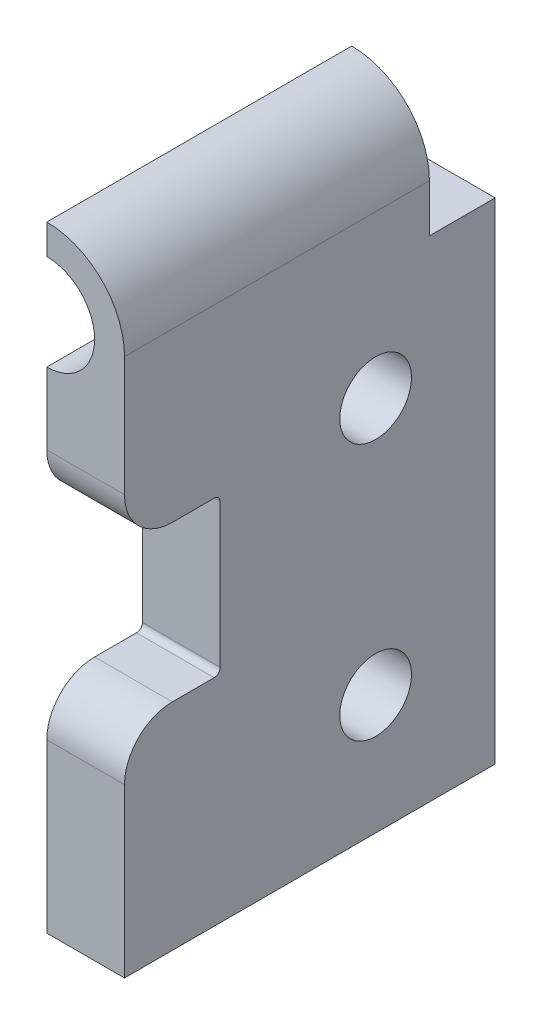
ISO-10303-21;
HEADER;
FILE_DESCRIPTION(('STEP AP214'),'2;1');
FILE_NAME('part.step','',(''),(''),'','','');
FILE_SCHEMA(('AUTOMOTIVE_DESIGN { 1 0 10303 214 1 1 1 1 }'));
ENDSEC;
DATA;
#1=APPLICATION_CONTEXT('core data for automotive mechanical design processes');
#2=APPLICATION_PROTOCOL_DEFINITION('international standard','automotive_design',2000,#1);
#3=PRODUCT_CONTEXT('',#1,'mechanical');
#4=PRODUCT('Part','Part','',(#3));
#5=PRODUCT_RELATED_PRODUCT_CATEGORY('part','',(#4));
#6=PRODUCT_DEFINITION_FORMATION('','',#4);
#7=PRODUCT_DEFINITION_CONTEXT('part definition',#1,'design');
#8=PRODUCT_DEFINITION('design','',#6,#7);
#9=PRODUCT_DEFINITION_SHAPE('','',#8);
#10=(LENGTH_UNIT() NAMED_UNIT(*) SI_UNIT(.MILLI.,.METRE.));
#11=(NAMED_UNIT(*) PLANE_ANGLE_UNIT() SI_UNIT($,.RADIAN.));
#12=(NAMED_UNIT(*) SI_UNIT($,.STERADIAN.) SOLID_ANGLE_UNIT());
#13=UNCERTAINTY_MEASURE_WITH_UNIT(LENGTH_MEASURE(1.E-05),#10,'distance_accuracy_value','');
#14=(GEOMETRIC_REPRESENTATION_CONTEXT(3) GLOBAL_UNCERTAINTY_ASSIGNED_CONTEXT((#13)) GLOBAL_UNIT_ASSIGNED_CONTEXT((#10,
#11,#12)) REPRESENTATION_CONTEXT('',''));
#15=CARTESIAN_POINT('',(0.,0.,0.));
#16=DIRECTION('',(0.,0.,1.));
#17=DIRECTION('',(1.,0.,0.));
#18=AXIS2_PLACEMENT_3D('',#15,#16,#17);
#19=CARTESIAN_POINT('',(-3.75,22.5,31.));
#20=DIRECTION('',(0.,0.,1.));
#21=DIRECTION('',(1.,0.,0.));
#22=AXIS2_PLACEMENT_3D('',#19,#20,#21);
#23=PLANE('',#22);
#24=DIRECTION('',(0.,1.,0.));
#25=VECTOR('',#24,1.);
#26=CARTESIAN_POINT('',(2.75,22.5,31.));
#27=LINE('',#26,#25);
#28=CARTESIAN_POINT('',(2.75,-22.5,31.));
#29=VERTEX_POINT('',#28);
#30=CARTESIAN_POINT('',(2.75,-8.49999999999999,31.));
#31=VERTEX_POINT('',#30);
#32=EDGE_CURVE('E335',#29,#31,#27,.T.);
#33=ORIENTED_EDGE('',*,*,#32,.T.);
#34=DIRECTION('',(-1.,0.,0.));
#35=VECTOR('',#34,1.);
#36=CARTESIAN_POINT('',(-3.75,-8.5,31.));
#37=LINE('',#36,#35);
#38=CARTESIAN_POINT('',(-3.75,-8.5,31.));
#39=VERTEX_POINT('',#38);
#40=EDGE_CURVE('E248',#31,#39,#37,.T.);
#41=ORIENTED_EDGE('',*,*,#40,.T.);
#42=DIRECTION('',(0.,-1.,0.));
#43=VECTOR('',#42,1.);
#44=CARTESIAN_POINT('',(-3.75,29.,31.));
#45=LINE('',#44,#43);
#46=CARTESIAN_POINT('',(-3.75,-22.5,31.));
#47=VERTEX_POINT('',#46);
#48=EDGE_CURVE('E181',#39,#47,#45,.T.);
#49=ORIENTED_EDGE('',*,*,#48,.T.);
#50=DIRECTION('',(1.,0.,0.));
#51=VECTOR('',#50,1.);
#52=CARTESIAN_POINT('',(-3.75,-22.5,31.));
#53=LINE('',#52,#51);
#54=EDGE_CURVE('E185',#47,#29,#53,.T.);
#55=ORIENTED_EDGE('',*,*,#54,.T.);
#56=EDGE_LOOP('',(#33,#41,#49,#55));
#57=FACE_BOUND('',#56,.T.);
#58=ADVANCED_FACE('F45',(#57),#23,.T.);
#59=CARTESIAN_POINT('',(-3.75,22.5,31.));
#60=DIRECTION('',(1.,0.,0.));
#61=DIRECTION('',(0.,1.,0.));
#62=AXIS2_PLACEMENT_3D('',#59,#60,#61);
#63=PLANE('',#62);
#64=CARTESIAN_POINT('',(-3.75,-12.5,10.));
#65=DIRECTION('',(-1.,0.,0.));
#66=DIRECTION('',(0.,-1.,0.));
#67=AXIS2_PLACEMENT_3D('',#64,#65,#66);
#68=CIRCLE('',#67,3.);
#69=CARTESIAN_POINT('',(-3.75,-15.5,10.));
#70=VERTEX_POINT('',#69);
#71=EDGE_CURVE('E306',#70,#70,#68,.T.);
#72=ORIENTED_EDGE('',*,*,#71,.F.);
#73=EDGE_LOOP('',(#72));
#74=FACE_BOUND('',#73,.T.);
#75=CARTESIAN_POINT('',(-3.75,9.,10.));
#76=DIRECTION('',(-1.,0.,0.));
#77=DIRECTION('',(0.,-1.,0.));
#78=AXIS2_PLACEMENT_3D('',#75,#76,#77);
#79=CIRCLE('',#78,3.);
#80=CARTESIAN_POINT('',(-3.75,6.,10.));
#81=VERTEX_POINT('',#80);
#82=EDGE_CURVE('E302',#81,#81,#79,.T.);
#83=ORIENTED_EDGE('',*,*,#82,.F.);
#84=EDGE_LOOP('',(#83));
#85=FACE_BOUND('',#84,.T.);
#86=ORIENTED_EDGE('',*,*,#48,.F.);
#87=CARTESIAN_POINT('',(-3.75,-8.5,27.));
#88=DIRECTION('',(1.,0.,0.));
#89=DIRECTION('',(0.,1.,0.));
#90=AXIS2_PLACEMENT_3D('',#87,#88,#89);
#91=CIRCLE('',#90,4.);
#92=CARTESIAN_POINT('',(-3.75,-4.5,27.));
#93=VERTEX_POINT('',#92);
#94=EDGE_CURVE('E254',#39,#93,#91,.F.);
#95=ORIENTED_EDGE('',*,*,#94,.T.);
#96=DIRECTION('',(0.,0.,1.));
#97=VECTOR('',#96,1.);
#98=CARTESIAN_POINT('',(-3.75,-4.5,31.));
#99=LINE('',#98,#97);
#100=CARTESIAN_POINT('',(-3.75,-4.5,23.5));
#101=VERTEX_POINT('',#100);
#102=EDGE_CURVE('E281',#101,#93,#99,.T.);
#103=ORIENTED_EDGE('',*,*,#102,.F.);
#104=CARTESIAN_POINT('',(-3.75,-4.,23.5));
#105=DIRECTION('',(1.,0.,0.));
#106=DIRECTION('',(0.,1.,0.));
#107=AXIS2_PLACEMENT_3D('',#104,#105,#106);
#108=CIRCLE('',#107,0.5);
#109=CARTESIAN_POINT('',(-3.75,-4.,23.));
#110=VERTEX_POINT('',#109);
#111=EDGE_CURVE('E234',#101,#110,#108,.T.);
#112=ORIENTED_EDGE('',*,*,#111,.T.);
#113=DIRECTION('',(0.,-1.,0.));
#114=VECTOR('',#113,1.);
#115=CARTESIAN_POINT('',(-3.75,8.5,23.));
#116=LINE('',#115,#114);
#117=CARTESIAN_POINT('',(-3.75,8.,23.));
#118=VERTEX_POINT('',#117);
#119=EDGE_CURVE('E275',#118,#110,#116,.T.);
#120=ORIENTED_EDGE('',*,*,#119,.F.);
#121=CARTESIAN_POINT('',(-3.75,8.,23.5));
#122=DIRECTION('',(1.,0.,0.));
#123=DIRECTION('',(0.,1.,0.));
#124=AXIS2_PLACEMENT_3D('',#121,#122,#123);
#125=CIRCLE('',#124,0.5);
#126=CARTESIAN_POINT('',(-3.75,8.5,23.5));
#127=VERTEX_POINT('',#126);
#128=EDGE_CURVE('E241',#118,#127,#125,.T.);
#129=ORIENTED_EDGE('',*,*,#128,.T.);
#130=DIRECTION('',(0.,0.,-1.));
#131=VECTOR('',#130,1.);
#132=CARTESIAN_POINT('',(-3.75,8.5,31.));
#133=LINE('',#132,#131);
#134=CARTESIAN_POINT('',(-3.75,8.5,27.));
#135=VERTEX_POINT('',#134);
#136=EDGE_CURVE('E269',#135,#127,#133,.T.);
#137=ORIENTED_EDGE('',*,*,#136,.F.);
#138=CARTESIAN_POINT('',(-3.75,12.5,27.));
#139=DIRECTION('',(1.,0.,0.));
#140=DIRECTION('',(0.,1.,0.));
#141=AXIS2_PLACEMENT_3D('',#138,#139,#140);
#142=CIRCLE('',#141,4.);
#143=CARTESIAN_POINT('',(-3.75,12.5,31.));
#144=VERTEX_POINT('',#143);
#145=EDGE_CURVE('E179',#135,#144,#142,.F.);
#146=ORIENTED_EDGE('',*,*,#145,.T.);
#147=CARTESIAN_POINT('',(-3.75,18.5,31.));
#148=VERTEX_POINT('',#147);
#149=EDGE_CURVE('E171',#148,#144,#45,.T.);
#150=ORIENTED_EDGE('',*,*,#149,.F.);
#151=DIRECTION('',(0.,0.,-1.));
#152=VECTOR('',#151,1.);
#153=CARTESIAN_POINT('',(-3.75,18.5,31.));
#154=LINE('',#153,#152);
#155=CARTESIAN_POINT('',(-3.75,18.5,5.5));
#156=VERTEX_POINT('',#155);
#157=EDGE_CURVE('E155',#148,#156,#154,.T.);
#158=ORIENTED_EDGE('',*,*,#157,.T.);
#159=DIRECTION('',(0.,0.,1.));
#160=VECTOR('',#159,1.);
#161=CARTESIAN_POINT('',(-3.75,18.5,0.));
#162=LINE('',#161,#160);
#163=CARTESIAN_POINT('',(-3.75,18.5,0.));
#164=VERTEX_POINT('',#163);
#165=EDGE_CURVE('E301',#164,#156,#162,.T.);
#166=ORIENTED_EDGE('',*,*,#165,.F.);
#167=DIRECTION('',(0.,-1.,0.));
#168=VECTOR('',#167,1.);
#169=CARTESIAN_POINT('',(-3.75,22.5,0.));
#170=LINE('',#169,#168);
#171=CARTESIAN_POINT('',(-3.75,-22.5,0.));
#172=VERTEX_POINT('',#171);
#173=EDGE_CURVE('E197',#164,#172,#170,.T.);
#174=ORIENTED_EDGE('',*,*,#173,.T.);
#175=DIRECTION('',(0.,0.,-1.));
#176=VECTOR('',#175,1.);
#177=CARTESIAN_POINT('',(-3.75,-22.5,31.));
#178=LINE('',#177,#176);
#179=EDGE_CURVE('E208',#47,#172,#178,.T.);
#180=ORIENTED_EDGE('',*,*,#179,.F.);
#181=EDGE_LOOP('',(#86,#95,#103,#112,#120,#129,#137,#146,#150,#158,#166,#174,#180));
#182=FACE_BOUND('',#181,.T.);
#183=ADVANCED_FACE('F177',(#74,#85,#182),#63,.F.);
#184=CARTESIAN_POINT('',(2.75,22.5,31.));
#185=DIRECTION('',(-1.,0.,0.));
#186=DIRECTION('',(0.,-1.,0.));
#187=AXIS2_PLACEMENT_3D('',#184,#185,#186);
#188=PLANE('',#187);
#189=CARTESIAN_POINT('',(2.75,9.,10.));
#190=DIRECTION('',(-1.,0.,0.));
#191=DIRECTION('',(0.,-1.,0.));
#192=AXIS2_PLACEMENT_3D('',#189,#190,#191);
#193=CIRCLE('',#192,3.);
#194=CARTESIAN_POINT('',(2.75,6.,10.));
#195=VERTEX_POINT('',#194);
#196=EDGE_CURVE('E297',#195,#195,#193,.T.);
#197=ORIENTED_EDGE('',*,*,#196,.T.);
#198=EDGE_LOOP('',(#197));
#199=FACE_BOUND('',#198,.T.);
#200=CARTESIAN_POINT('',(2.75000000000001,-12.5,10.));
#201=DIRECTION('',(-1.,0.,0.));
#202=DIRECTION('',(0.,-1.,0.));
#203=AXIS2_PLACEMENT_3D('',#200,#201,#202);
#204=CIRCLE('',#203,3.);
#205=CARTESIAN_POINT('',(2.75000000000001,-15.5,10.));
#206=VERTEX_POINT('',#205);
#207=EDGE_CURVE('E295',#206,#206,#204,.T.);
#208=ORIENTED_EDGE('',*,*,#207,.T.);
#209=EDGE_LOOP('',(#208));
#210=FACE_BOUND('',#209,.T.);
#211=DIRECTION('',(0.,0.,-1.));
#212=VECTOR('',#211,1.);
#213=CARTESIAN_POINT('',(2.75,-4.5,31.));
#214=LINE('',#213,#212);
#215=CARTESIAN_POINT('',(2.75,-4.5,27.));
#216=VERTEX_POINT('',#215);
#217=CARTESIAN_POINT('',(2.75,-4.5,23.5));
#218=VERTEX_POINT('',#217);
#219=EDGE_CURVE('E276',#216,#218,#214,.T.);
#220=ORIENTED_EDGE('',*,*,#219,.F.);
#221=CARTESIAN_POINT('',(2.75,-8.5,27.));
#222=DIRECTION('',(-1.,0.,0.));
#223=DIRECTION('',(0.,-1.,0.));
#224=AXIS2_PLACEMENT_3D('',#221,#222,#223);
#225=CIRCLE('',#224,4.);
#226=EDGE_CURVE('E262',#216,#31,#225,.F.);
#227=ORIENTED_EDGE('',*,*,#226,.T.);
#228=ORIENTED_EDGE('',*,*,#32,.F.);
#229=DIRECTION('',(0.,0.,-1.));
#230=VECTOR('',#229,1.);
#231=CARTESIAN_POINT('',(2.75,-22.5,31.));
#232=LINE('',#231,#230);
#233=CARTESIAN_POINT('',(2.75,-22.5,0.));
#234=VERTEX_POINT('',#233);
#235=EDGE_CURVE('E192',#29,#234,#232,.T.);
#236=ORIENTED_EDGE('',*,*,#235,.T.);
#237=DIRECTION('',(0.,1.,0.));
#238=VECTOR('',#237,1.);
#239=CARTESIAN_POINT('',(2.75,22.5,0.));
#240=LINE('',#239,#238);
#241=CARTESIAN_POINT('',(2.75,18.5,0.));
#242=VERTEX_POINT('',#241);
#243=EDGE_CURVE('E193',#234,#242,#240,.T.);
#244=ORIENTED_EDGE('',*,*,#243,.T.);
#245=DIRECTION('',(0.,0.,1.));
#246=VECTOR('',#245,1.);
#247=CARTESIAN_POINT('',(2.75,18.5,0.));
#248=LINE('',#247,#246);
#249=CARTESIAN_POINT('',(2.75,18.5,5.5));
#250=VERTEX_POINT('',#249);
#251=EDGE_CURVE('E313',#242,#250,#248,.T.);
#252=ORIENTED_EDGE('',*,*,#251,.T.);
#253=DIRECTION('',(0.,1.,0.));
#254=VECTOR('',#253,1.);
#255=CARTESIAN_POINT('',(2.75,29.,5.5));
#256=LINE('',#255,#254);
#257=CARTESIAN_POINT('',(2.75,22.5,5.5));
#258=VERTEX_POINT('',#257);
#259=EDGE_CURVE('E317',#250,#258,#256,.T.);
#260=ORIENTED_EDGE('',*,*,#259,.T.);
#261=DIRECTION('',(0.,0.,-1.));
#262=VECTOR('',#261,1.);
#263=CARTESIAN_POINT('',(2.75,22.5,31.));
#264=LINE('',#263,#262);
#265=CARTESIAN_POINT('',(2.75,22.5,31.));
#266=VERTEX_POINT('',#265);
#267=EDGE_CURVE('E216',#266,#258,#264,.T.);
#268=ORIENTED_EDGE('',*,*,#267,.F.);
#269=CARTESIAN_POINT('',(2.75,12.5,31.));
#270=VERTEX_POINT('',#269);
#271=EDGE_CURVE('E204',#270,#266,#27,.T.);
#272=ORIENTED_EDGE('',*,*,#271,.F.);
#273=CARTESIAN_POINT('',(2.75,12.5,27.));
#274=DIRECTION('',(-1.,0.,0.));
#275=DIRECTION('',(0.,-1.,0.));
#276=AXIS2_PLACEMENT_3D('',#273,#274,#275);
#277=CIRCLE('',#276,4.);
#278=CARTESIAN_POINT('',(2.75,8.5,27.));
#279=VERTEX_POINT('',#278);
#280=EDGE_CURVE('E61',#270,#279,#277,.F.);
#281=ORIENTED_EDGE('',*,*,#280,.T.);
#282=DIRECTION('',(0.,0.,1.));
#283=VECTOR('',#282,1.);
#284=CARTESIAN_POINT('',(2.75,8.5,31.));
#285=LINE('',#284,#283);
#286=CARTESIAN_POINT('',(2.75,8.5,23.5));
#287=VERTEX_POINT('',#286);
#288=EDGE_CURVE('E270',#287,#279,#285,.T.);
#289=ORIENTED_EDGE('',*,*,#288,.F.);
#290=CARTESIAN_POINT('',(2.75,8.,23.5));
#291=DIRECTION('',(-1.,0.,0.));
#292=DIRECTION('',(0.,-1.,0.));
#293=AXIS2_PLACEMENT_3D('',#290,#291,#292);
#294=CIRCLE('',#293,0.5);
#295=CARTESIAN_POINT('',(2.75,8.,23.));
#296=VERTEX_POINT('',#295);
#297=EDGE_CURVE('E245',#287,#296,#294,.T.);
#298=ORIENTED_EDGE('',*,*,#297,.T.);
#299=DIRECTION('',(0.,1.,0.));
#300=VECTOR('',#299,1.);
#301=CARTESIAN_POINT('',(2.75,8.5,23.));
#302=LINE('',#301,#300);
#303=CARTESIAN_POINT('',(2.75,-4.,23.));
#304=VERTEX_POINT('',#303);
#305=EDGE_CURVE('E283',#304,#296,#302,.T.);
#306=ORIENTED_EDGE('',*,*,#305,.F.);
#307=CARTESIAN_POINT('',(2.75,-4.,23.5));
#308=DIRECTION('',(-1.,0.,0.));
#309=DIRECTION('',(0.,-1.,0.));
#310=AXIS2_PLACEMENT_3D('',#307,#308,#309);
#311=CIRCLE('',#310,0.5);
#312=EDGE_CURVE('E237',#304,#218,#311,.T.);
#313=ORIENTED_EDGE('',*,*,#312,.T.);
#314=EDGE_LOOP('',(#220,#227,#228,#236,#244,#252,#260,#268,#272,#281,#289,#298,#306,#313));
#315=FACE_BOUND('',#314,.T.);
#316=ADVANCED_FACE('F349',(#199,#210,#315),#188,.F.);
#317=CARTESIAN_POINT('',(-3.75,22.5,31.));
#318=DIRECTION('',(0.,0.,-1.));
#319=DIRECTION('',(-1.,0.,0.));
#320=AXIS2_PLACEMENT_3D('',#317,#318,#319);
#321=CYLINDRICAL_SURFACE('',#320,6.5);
#322=ORIENTED_EDGE('',*,*,#267,.T.);
#323=CARTESIAN_POINT('',(-3.75,22.5,5.5));
#324=DIRECTION('',(0.,0.,1.));
#325=DIRECTION('',(0.,-1.,0.));
#326=AXIS2_PLACEMENT_3D('',#323,#324,#325);
#327=CIRCLE('',#326,6.5);
#328=CARTESIAN_POINT('',(-3.75,29.,5.5));
#329=VERTEX_POINT('',#328);
#330=EDGE_CURVE('E198',#258,#329,#327,.T.);
#331=ORIENTED_EDGE('',*,*,#330,.T.);
#332=DIRECTION('',(0.,0.,-1.));
#333=VECTOR('',#332,1.);
#334=CARTESIAN_POINT('',(-3.75,29.,31.));
#335=LINE('',#334,#333);
#336=CARTESIAN_POINT('',(-3.75,29.,31.));
#337=VERTEX_POINT('',#336);
#338=EDGE_CURVE('E212',#337,#329,#335,.T.);
#339=ORIENTED_EDGE('',*,*,#338,.F.);
#340=CARTESIAN_POINT('',(-3.75,22.5,31.));
#341=DIRECTION('',(0.,0.,1.));
#342=DIRECTION('',(1.,0.,0.));
#343=AXIS2_PLACEMENT_3D('',#340,#341,#342);
#344=CIRCLE('',#343,6.5);
#345=EDGE_CURVE('E186',#266,#337,#344,.T.);
#346=ORIENTED_EDGE('',*,*,#345,.F.);
#347=EDGE_LOOP('',(#322,#331,#339,#346));
#348=FACE_BOUND('',#347,.T.);
#349=ADVANCED_FACE('F347',(#348),#321,.T.);
#350=DIRECTION('',(0.,1.,0.));
#351=VECTOR('',#350,1.);
#352=CARTESIAN_POINT('',(-3.75,29.,5.5));
#353=LINE('',#352,#351);
#354=CARTESIAN_POINT('',(-3.75,26.5,5.5));
#355=VERTEX_POINT('',#354);
#356=EDGE_CURVE('E318',#355,#329,#353,.T.);
#357=ORIENTED_EDGE('',*,*,#356,.F.);
#358=DIRECTION('',(0.,0.,-1.));
#359=VECTOR('',#358,1.);
#360=CARTESIAN_POINT('',(-3.75,26.5,31.));
#361=LINE('',#360,#359);
#362=CARTESIAN_POINT('',(-3.75,26.5,31.));
#363=VERTEX_POINT('',#362);
#364=EDGE_CURVE('E167',#363,#355,#361,.T.);
#365=ORIENTED_EDGE('',*,*,#364,.F.);
#366=EDGE_CURVE('E173',#337,#363,#45,.T.);
#367=ORIENTED_EDGE('',*,*,#366,.F.);
#368=ORIENTED_EDGE('',*,*,#338,.T.);
#369=EDGE_LOOP('',(#357,#365,#367,#368));
#370=FACE_BOUND('',#369,.T.);
#371=ADVANCED_FACE('F355',(#370),#63,.F.);
#372=CARTESIAN_POINT('',(-3.75,-22.5,31.));
#373=DIRECTION('',(0.,1.,0.));
#374=DIRECTION('',(0.,0.,1.));
#375=AXIS2_PLACEMENT_3D('',#372,#373,#374);
#376=PLANE('',#375);
#377=DIRECTION('',(1.,0.,0.));
#378=VECTOR('',#377,1.);
#379=CARTESIAN_POINT('',(-3.75,-22.5,0.));
#380=LINE('',#379,#378);
#381=EDGE_CURVE('E201',#172,#234,#380,.T.);
#382=ORIENTED_EDGE('',*,*,#381,.T.);
#383=ORIENTED_EDGE('',*,*,#235,.F.);
#384=ORIENTED_EDGE('',*,*,#54,.F.);
#385=ORIENTED_EDGE('',*,*,#179,.T.);
#386=EDGE_LOOP('',(#382,#383,#384,#385));
#387=FACE_BOUND('',#386,.T.);
#388=ADVANCED_FACE('F357',(#387),#376,.F.);
#389=ORIENTED_EDGE('',*,*,#149,.T.);
#390=DIRECTION('',(-1.,0.,0.));
#391=VECTOR('',#390,1.);
#392=CARTESIAN_POINT('',(2.75,12.5,31.));
#393=LINE('',#392,#391);
#394=EDGE_CURVE('E11',#144,#270,#393,.F.);
#395=ORIENTED_EDGE('',*,*,#394,.T.);
#396=ORIENTED_EDGE('',*,*,#271,.T.);
#397=ORIENTED_EDGE('',*,*,#345,.T.);
#398=ORIENTED_EDGE('',*,*,#366,.T.);
#399=CARTESIAN_POINT('',(-3.75,22.5,31.));
#400=DIRECTION('',(0.,0.,-1.));
#401=DIRECTION('',(0.,-1.,0.));
#402=AXIS2_PLACEMENT_3D('',#399,#400,#401);
#403=CIRCLE('',#402,4.);
#404=EDGE_CURVE('E158',#363,#148,#403,.T.);
#405=ORIENTED_EDGE('',*,*,#404,.T.);
#406=EDGE_LOOP('',(#389,#395,#396,#397,#398,#405));
#407=FACE_BOUND('',#406,.T.);
#408=ADVANCED_FACE('F170',(#407),#23,.T.);
#409=CARTESIAN_POINT('',(-3.75,22.5,0.));
#410=DIRECTION('',(0.,0.,1.));
#411=DIRECTION('',(1.,0.,0.));
#412=AXIS2_PLACEMENT_3D('',#409,#410,#411);
#413=PLANE('',#412);
#414=ORIENTED_EDGE('',*,*,#173,.F.);
#415=DIRECTION('',(-1.,0.,0.));
#416=VECTOR('',#415,1.);
#417=CARTESIAN_POINT('',(2.75,18.5,0.));
#418=LINE('',#417,#416);
#419=EDGE_CURVE('E322',#242,#164,#418,.T.);
#420=ORIENTED_EDGE('',*,*,#419,.F.);
#421=ORIENTED_EDGE('',*,*,#243,.F.);
#422=ORIENTED_EDGE('',*,*,#381,.F.);
#423=EDGE_LOOP('',(#414,#420,#421,#422));
#424=FACE_BOUND('',#423,.T.);
#425=ADVANCED_FACE('F378',(#424),#413,.F.);
#426=CARTESIAN_POINT('',(2.75,29.,5.5));
#427=DIRECTION('',(0.,0.,1.));
#428=DIRECTION('',(0.,-1.,0.));
#429=AXIS2_PLACEMENT_3D('',#426,#427,#428);
#430=PLANE('',#429);
#431=DIRECTION('',(-1.,0.,0.));
#432=VECTOR('',#431,1.);
#433=CARTESIAN_POINT('',(2.75,18.5,5.5));
#434=LINE('',#433,#432);
#435=EDGE_CURVE('E328',#250,#156,#434,.T.);
#436=ORIENTED_EDGE('',*,*,#435,.T.);
#437=CARTESIAN_POINT('',(-3.75,22.5,5.5));
#438=DIRECTION('',(0.,0.,-1.));
#439=DIRECTION('',(0.,-1.,0.));
#440=AXIS2_PLACEMENT_3D('',#437,#438,#439);
#441=CIRCLE('',#440,4.);
#442=EDGE_CURVE('E161',#355,#156,#441,.T.);
#443=ORIENTED_EDGE('',*,*,#442,.F.);
#444=ORIENTED_EDGE('',*,*,#356,.T.);
#445=ORIENTED_EDGE('',*,*,#330,.F.);
#446=ORIENTED_EDGE('',*,*,#259,.F.);
#447=EDGE_LOOP('',(#436,#443,#444,#445,#446));
#448=FACE_BOUND('',#447,.T.);
#449=ADVANCED_FACE('F352',(#448),#430,.F.);
#450=CARTESIAN_POINT('',(2.75,18.5,0.));
#451=DIRECTION('',(0.,-1.,0.));
#452=DIRECTION('',(1.,0.,0.));
#453=AXIS2_PLACEMENT_3D('',#450,#451,#452);
#454=PLANE('',#453);
#455=ORIENTED_EDGE('',*,*,#165,.T.);
#456=ORIENTED_EDGE('',*,*,#435,.F.);
#457=ORIENTED_EDGE('',*,*,#251,.F.);
#458=ORIENTED_EDGE('',*,*,#419,.T.);
#459=EDGE_LOOP('',(#455,#456,#457,#458));
#460=FACE_BOUND('',#459,.T.);
#461=ADVANCED_FACE('F388',(#460),#454,.F.);
#462=CARTESIAN_POINT('',(2.75000000000001,-12.5,10.));
#463=DIRECTION('',(-1.,0.,0.));
#464=DIRECTION('',(0.,-1.,0.));
#465=AXIS2_PLACEMENT_3D('',#462,#463,#464);
#466=CYLINDRICAL_SURFACE('',#465,3.);
#467=ORIENTED_EDGE('',*,*,#207,.F.);
#468=EDGE_LOOP('',(#467));
#469=FACE_BOUND('',#468,.T.);
#470=ORIENTED_EDGE('',*,*,#71,.T.);
#471=EDGE_LOOP('',(#470));
#472=FACE_BOUND('',#471,.T.);
#473=ADVANCED_FACE('F431',(#469,#472),#466,.F.);
#474=CARTESIAN_POINT('',(2.75,9.,10.));
#475=DIRECTION('',(-1.,0.,0.));
#476=DIRECTION('',(0.,-1.,0.));
#477=AXIS2_PLACEMENT_3D('',#474,#475,#476);
#478=CYLINDRICAL_SURFACE('',#477,3.);
#479=ORIENTED_EDGE('',*,*,#196,.F.);
#480=EDGE_LOOP('',(#479));
#481=FACE_BOUND('',#480,.T.);
#482=ORIENTED_EDGE('',*,*,#82,.T.);
#483=EDGE_LOOP('',(#482));
#484=FACE_BOUND('',#483,.T.);
#485=ADVANCED_FACE('F433',(#481,#484),#478,.F.);
#486=CARTESIAN_POINT('',(-3.75,22.5,31.));
#487=DIRECTION('',(0.,0.,-1.));
#488=DIRECTION('',(0.,1.,0.));
#489=AXIS2_PLACEMENT_3D('',#486,#487,#488);
#490=CYLINDRICAL_SURFACE('',#489,4.);
#491=ORIENTED_EDGE('',*,*,#442,.T.);
#492=ORIENTED_EDGE('',*,*,#157,.F.);
#493=ORIENTED_EDGE('',*,*,#404,.F.);
#494=ORIENTED_EDGE('',*,*,#364,.T.);
#495=EDGE_LOOP('',(#491,#492,#493,#494));
#496=FACE_BOUND('',#495,.T.);
#497=ADVANCED_FACE('F157',(#496),#490,.F.);
#498=CARTESIAN_POINT('',(2.75100000000001,-4.5,31.));
#499=DIRECTION('',(0.,-1.,0.));
#500=DIRECTION('',(1.,0.,0.));
#501=AXIS2_PLACEMENT_3D('',#498,#499,#500);
#502=PLANE('',#501);
#503=ORIENTED_EDGE('',*,*,#102,.T.);
#504=DIRECTION('',(-1.,0.,0.));
#505=VECTOR('',#504,1.);
#506=CARTESIAN_POINT('',(2.75,-4.5,27.));
#507=LINE('',#506,#505);
#508=EDGE_CURVE('E257',#93,#216,#507,.F.);
#509=ORIENTED_EDGE('',*,*,#508,.T.);
#510=ORIENTED_EDGE('',*,*,#219,.T.);
#511=DIRECTION('',(-1.,0.,0.));
#512=VECTOR('',#511,1.);
#513=CARTESIAN_POINT('',(-3.75,-4.5,23.5));
#514=LINE('',#513,#512);
#515=EDGE_CURVE('E220',#218,#101,#514,.T.);
#516=ORIENTED_EDGE('',*,*,#515,.T.);
#517=EDGE_LOOP('',(#503,#509,#510,#516));
#518=FACE_BOUND('',#517,.T.);
#519=ADVANCED_FACE('F401',(#518),#502,.F.);
#520=CARTESIAN_POINT('',(2.75100000000001,8.5,23.));
#521=DIRECTION('',(0.,0.,-1.));
#522=DIRECTION('',(-1.,0.,0.));
#523=AXIS2_PLACEMENT_3D('',#520,#521,#522);
#524=PLANE('',#523);
#525=ORIENTED_EDGE('',*,*,#119,.T.);
#526=DIRECTION('',(-1.,0.,0.));
#527=VECTOR('',#526,1.);
#528=CARTESIAN_POINT('',(2.75,-4.,23.));
#529=LINE('',#528,#527);
#530=EDGE_CURVE('E228',#110,#304,#529,.F.);
#531=ORIENTED_EDGE('',*,*,#530,.T.);
#532=ORIENTED_EDGE('',*,*,#305,.T.);
#533=DIRECTION('',(-1.,0.,0.));
#534=VECTOR('',#533,1.);
#535=CARTESIAN_POINT('',(-3.75,8.,23.));
#536=LINE('',#535,#534);
#537=EDGE_CURVE('E224',#296,#118,#536,.T.);
#538=ORIENTED_EDGE('',*,*,#537,.T.);
#539=EDGE_LOOP('',(#525,#531,#532,#538));
#540=FACE_BOUND('',#539,.T.);
#541=ADVANCED_FACE('F412',(#540),#524,.F.);
#542=CARTESIAN_POINT('',(2.75100000000001,8.5,31.));
#543=DIRECTION('',(0.,1.,0.));
#544=DIRECTION('',(0.,0.,1.));
#545=AXIS2_PLACEMENT_3D('',#542,#543,#544);
#546=PLANE('',#545);
#547=ORIENTED_EDGE('',*,*,#288,.T.);
#548=DIRECTION('',(-1.,0.,0.));
#549=VECTOR('',#548,1.);
#550=CARTESIAN_POINT('',(-3.75,8.5,27.));
#551=LINE('',#550,#549);
#552=EDGE_CURVE('E54',#279,#135,#551,.T.);
#553=ORIENTED_EDGE('',*,*,#552,.T.);
#554=ORIENTED_EDGE('',*,*,#136,.T.);
#555=DIRECTION('',(-1.,0.,0.));
#556=VECTOR('',#555,1.);
#557=CARTESIAN_POINT('',(2.75,8.5,23.5));
#558=LINE('',#557,#556);
#559=EDGE_CURVE('E231',#127,#287,#558,.F.);
#560=ORIENTED_EDGE('',*,*,#559,.T.);
#561=EDGE_LOOP('',(#547,#553,#554,#560));
#562=FACE_BOUND('',#561,.T.);
#563=ADVANCED_FACE('F268',(#562),#546,.F.);
#564=CARTESIAN_POINT('',(2.75100000000001,-4.,23.5));
#565=DIRECTION('',(1.,0.,0.));
#566=DIRECTION('',(0.,1.,0.));
#567=AXIS2_PLACEMENT_3D('',#564,#565,#566);
#568=CYLINDRICAL_SURFACE('',#567,0.5);
#569=ORIENTED_EDGE('',*,*,#312,.F.);
#570=ORIENTED_EDGE('',*,*,#530,.F.);
#571=ORIENTED_EDGE('',*,*,#111,.F.);
#572=ORIENTED_EDGE('',*,*,#515,.F.);
#573=EDGE_LOOP('',(#569,#570,#571,#572));
#574=FACE_BOUND('',#573,.T.);
#575=ADVANCED_FACE('F410',(#574),#568,.F.);
#576=CARTESIAN_POINT('',(2.75100000000001,8.,23.5));
#577=DIRECTION('',(1.,0.,0.));
#578=DIRECTION('',(0.,1.,0.));
#579=AXIS2_PLACEMENT_3D('',#576,#577,#578);
#580=CYLINDRICAL_SURFACE('',#579,0.5);
#581=ORIENTED_EDGE('',*,*,#297,.F.);
#582=ORIENTED_EDGE('',*,*,#559,.F.);
#583=ORIENTED_EDGE('',*,*,#128,.F.);
#584=ORIENTED_EDGE('',*,*,#537,.F.);
#585=EDGE_LOOP('',(#581,#582,#583,#584));
#586=FACE_BOUND('',#585,.T.);
#587=ADVANCED_FACE('F416',(#586),#580,.F.);
#588=CARTESIAN_POINT('',(-3.75,-8.5,27.));
#589=DIRECTION('',(1.,0.,0.));
#590=DIRECTION('',(0.,1.,0.));
#591=AXIS2_PLACEMENT_3D('',#588,#589,#590);
#592=CYLINDRICAL_SURFACE('',#591,4.);
#593=ORIENTED_EDGE('',*,*,#226,.F.);
#594=ORIENTED_EDGE('',*,*,#508,.F.);
#595=ORIENTED_EDGE('',*,*,#94,.F.);
#596=ORIENTED_EDGE('',*,*,#40,.F.);
#597=EDGE_LOOP('',(#593,#594,#595,#596));
#598=FACE_BOUND('',#597,.T.);
#599=ADVANCED_FACE('F404',(#598),#592,.T.);
#600=CARTESIAN_POINT('',(2.75100000000001,12.5,27.));
#601=DIRECTION('',(1.,0.,0.));
#602=DIRECTION('',(0.,1.,0.));
#603=AXIS2_PLACEMENT_3D('',#600,#601,#602);
#604=CYLINDRICAL_SURFACE('',#603,4.);
#605=ORIENTED_EDGE('',*,*,#280,.F.);
#606=ORIENTED_EDGE('',*,*,#394,.F.);
#607=ORIENTED_EDGE('',*,*,#145,.F.);
#608=ORIENTED_EDGE('',*,*,#552,.F.);
#609=EDGE_LOOP('',(#605,#606,#607,#608));
#610=FACE_BOUND('',#609,.T.);
#611=ADVANCED_FACE('F47',(#610),#604,.T.);
#612=CLOSED_SHELL('',(#58,#183,#316,#349,#371,#388,#408,#425,#449,#461,#473,#485,#497,#519,#541,
#563,#575,#587,#599,#611));
#613=MANIFOLD_SOLID_BREP('B2',#612);
#614=ADVANCED_BREP_SHAPE_REPRESENTATION('',(#18,#613),#14);
#615=SHAPE_DEFINITION_REPRESENTATION(#9,#614);
ENDSEC;
END-ISO-10303-21;
